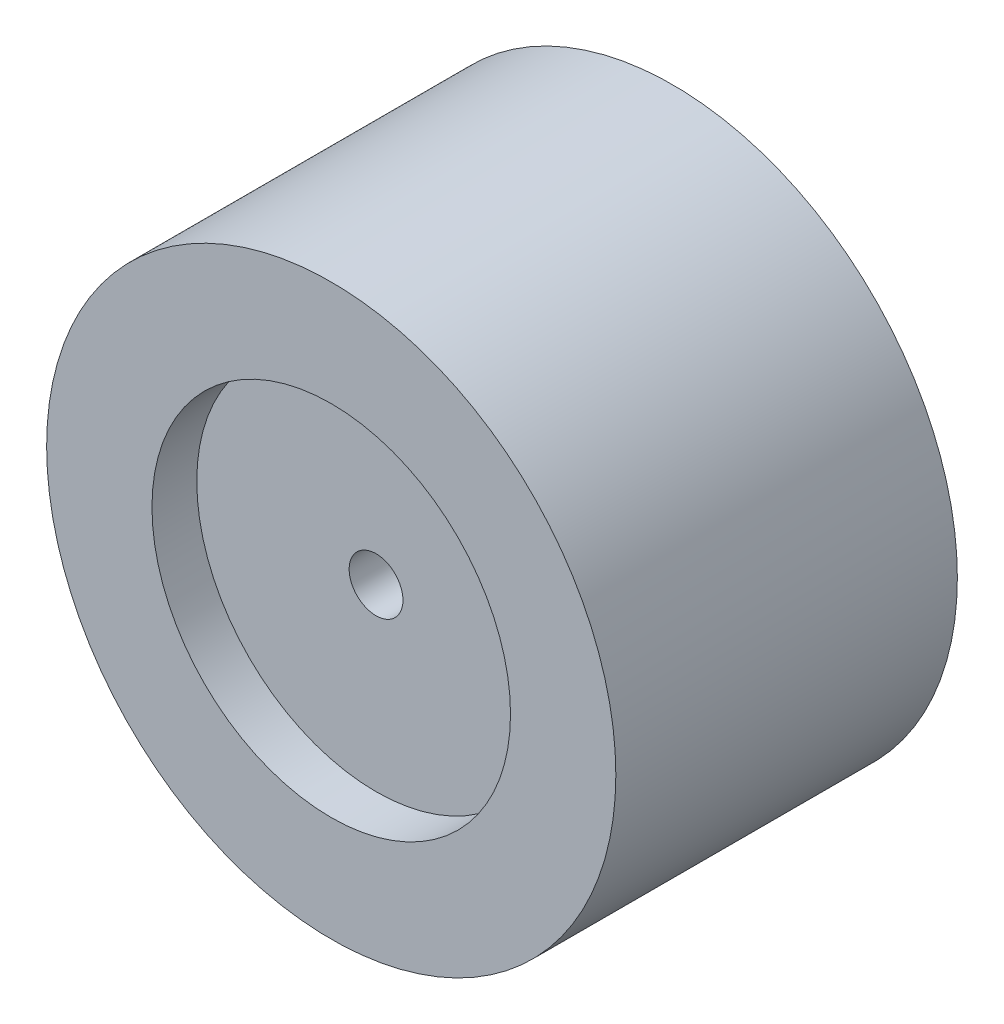
ISO-10303-21;
HEADER;
FILE_DESCRIPTION(('STEP AP214'),'2;1');
FILE_NAME('part.step','',(''),(''),'','','');
FILE_SCHEMA(('AUTOMOTIVE_DESIGN { 1 0 10303 214 1 1 1 1 }'));
ENDSEC;
DATA;
#1=APPLICATION_CONTEXT('core data for automotive mechanical design processes');
#2=APPLICATION_PROTOCOL_DEFINITION('international standard','automotive_design',2000,#1);
#3=PRODUCT_CONTEXT('',#1,'mechanical');
#4=PRODUCT('Part','Part','',(#3));
#5=PRODUCT_RELATED_PRODUCT_CATEGORY('part','',(#4));
#6=PRODUCT_DEFINITION_FORMATION('','',#4);
#7=PRODUCT_DEFINITION_CONTEXT('part definition',#1,'design');
#8=PRODUCT_DEFINITION('design','',#6,#7);
#9=PRODUCT_DEFINITION_SHAPE('','',#8);
#10=(LENGTH_UNIT() NAMED_UNIT(*) SI_UNIT(.MILLI.,.METRE.));
#11=(NAMED_UNIT(*) PLANE_ANGLE_UNIT() SI_UNIT($,.RADIAN.));
#12=(NAMED_UNIT(*) SI_UNIT($,.STERADIAN.) SOLID_ANGLE_UNIT());
#13=UNCERTAINTY_MEASURE_WITH_UNIT(LENGTH_MEASURE(1.E-05),#10,'distance_accuracy_value','');
#14=(GEOMETRIC_REPRESENTATION_CONTEXT(3) GLOBAL_UNCERTAINTY_ASSIGNED_CONTEXT((#13)) GLOBAL_UNIT_ASSIGNED_CONTEXT((#10,
#11,#12)) REPRESENTATION_CONTEXT('',''));
#15=CARTESIAN_POINT('',(0.,0.,0.));
#16=DIRECTION('',(0.,0.,1.));
#17=DIRECTION('',(1.,0.,0.));
#18=AXIS2_PLACEMENT_3D('',#15,#16,#17);
#19=CARTESIAN_POINT('',(0.,0.,38.1));
#20=DIRECTION('',(0.,0.,-1.));
#21=DIRECTION('',(-1.,0.,0.));
#22=AXIS2_PLACEMENT_3D('',#19,#20,#21);
#23=CYLINDRICAL_SURFACE('',#22,3.);
#24=CARTESIAN_POINT('',(0.,0.,0.));
#25=DIRECTION('',(0.,0.,1.));
#26=DIRECTION('',(1.,0.,0.));
#27=AXIS2_PLACEMENT_3D('',#24,#25,#26);
#28=CIRCLE('',#27,3.);
#29=CARTESIAN_POINT('',(3.,0.,0.));
#30=VERTEX_POINT('',#29);
#31=EDGE_CURVE('E43',#30,#30,#28,.T.);
#32=ORIENTED_EDGE('',*,*,#31,.F.);
#33=EDGE_LOOP('',(#32));
#34=FACE_BOUND('',#33,.T.);
#35=CARTESIAN_POINT('',(0.,0.,33.1));
#36=DIRECTION('',(0.,0.,1.));
#37=DIRECTION('',(1.,0.,0.));
#38=AXIS2_PLACEMENT_3D('',#35,#36,#37);
#39=CIRCLE('',#38,3.);
#40=CARTESIAN_POINT('',(3.,0.,33.1));
#41=VERTEX_POINT('',#40);
#42=EDGE_CURVE('E34',#41,#41,#39,.T.);
#43=ORIENTED_EDGE('',*,*,#42,.T.);
#44=EDGE_LOOP('',(#43));
#45=FACE_BOUND('',#44,.T.);
#46=ADVANCED_FACE('F30',(#34,#45),#23,.F.);
#47=CARTESIAN_POINT('',(0.,0.,38.1));
#48=DIRECTION('',(0.,0.,1.));
#49=DIRECTION('',(1.,0.,0.));
#50=AXIS2_PLACEMENT_3D('',#47,#48,#49);
#51=PLANE('',#50);
#52=CARTESIAN_POINT('',(0.,0.,38.1));
#53=DIRECTION('',(0.,0.,1.));
#54=DIRECTION('',(1.,0.,0.));
#55=AXIS2_PLACEMENT_3D('',#52,#53,#54);
#56=CIRCLE('',#55,20.);
#57=CARTESIAN_POINT('',(20.,0.,38.1));
#58=VERTEX_POINT('',#57);
#59=EDGE_CURVE('E47',#58,#58,#56,.T.);
#60=ORIENTED_EDGE('',*,*,#59,.F.);
#61=EDGE_LOOP('',(#60));
#62=FACE_BOUND('',#61,.T.);
#63=CARTESIAN_POINT('',(0.,0.,38.1));
#64=DIRECTION('',(0.,0.,1.));
#65=DIRECTION('',(1.,0.,0.));
#66=AXIS2_PLACEMENT_3D('',#63,#64,#65);
#67=CIRCLE('',#66,31.75);
#68=CARTESIAN_POINT('',(31.75,0.,38.1));
#69=VERTEX_POINT('',#68);
#70=EDGE_CURVE('E10',#69,#69,#67,.T.);
#71=ORIENTED_EDGE('',*,*,#70,.T.);
#72=EDGE_LOOP('',(#71));
#73=FACE_BOUND('',#72,.T.);
#74=ADVANCED_FACE('F68',(#62,#73),#51,.T.);
#75=CARTESIAN_POINT('',(0.,0.,0.));
#76=DIRECTION('',(0.,0.,1.));
#77=DIRECTION('',(1.,0.,0.));
#78=AXIS2_PLACEMENT_3D('',#75,#76,#77);
#79=PLANE('',#78);
#80=CARTESIAN_POINT('',(0.,0.,0.));
#81=DIRECTION('',(0.,0.,1.));
#82=DIRECTION('',(1.,0.,0.));
#83=AXIS2_PLACEMENT_3D('',#80,#81,#82);
#84=CIRCLE('',#83,31.75);
#85=CARTESIAN_POINT('',(31.75,0.,0.));
#86=VERTEX_POINT('',#85);
#87=EDGE_CURVE('E38',#86,#86,#84,.T.);
#88=ORIENTED_EDGE('',*,*,#87,.F.);
#89=EDGE_LOOP('',(#88));
#90=FACE_BOUND('',#89,.T.);
#91=ORIENTED_EDGE('',*,*,#31,.T.);
#92=EDGE_LOOP('',(#91));
#93=FACE_BOUND('',#92,.T.);
#94=ADVANCED_FACE('F74',(#90,#93),#79,.F.);
#95=CARTESIAN_POINT('',(0.,0.,38.1));
#96=DIRECTION('',(0.,0.,-1.));
#97=DIRECTION('',(-1.,0.,0.));
#98=AXIS2_PLACEMENT_3D('',#95,#96,#97);
#99=CYLINDRICAL_SURFACE('',#98,31.75);
#100=ORIENTED_EDGE('',*,*,#70,.F.);
#101=EDGE_LOOP('',(#100));
#102=FACE_BOUND('',#101,.T.);
#103=ORIENTED_EDGE('',*,*,#87,.T.);
#104=EDGE_LOOP('',(#103));
#105=FACE_BOUND('',#104,.T.);
#106=ADVANCED_FACE('F32',(#102,#105),#99,.T.);
#107=CARTESIAN_POINT('',(0.,0.,33.1));
#108=DIRECTION('',(0.,0.,1.));
#109=DIRECTION('',(1.,0.,0.));
#110=AXIS2_PLACEMENT_3D('',#107,#108,#109);
#111=CYLINDRICAL_SURFACE('',#110,20.);
#112=CARTESIAN_POINT('',(0.,0.,33.1));
#113=DIRECTION('',(0.,0.,1.));
#114=DIRECTION('',(1.,0.,0.));
#115=AXIS2_PLACEMENT_3D('',#112,#113,#114);
#116=CIRCLE('',#115,20.);
#117=CARTESIAN_POINT('',(20.,0.,33.1));
#118=VERTEX_POINT('',#117);
#119=EDGE_CURVE('E50',#118,#118,#116,.T.);
#120=ORIENTED_EDGE('',*,*,#119,.F.);
#121=EDGE_LOOP('',(#120));
#122=FACE_BOUND('',#121,.T.);
#123=ORIENTED_EDGE('',*,*,#59,.T.);
#124=EDGE_LOOP('',(#123));
#125=FACE_BOUND('',#124,.T.);
#126=ADVANCED_FACE('F60',(#122,#125),#111,.F.);
#127=CARTESIAN_POINT('',(0.,0.,33.1));
#128=DIRECTION('',(0.,0.,1.));
#129=DIRECTION('',(1.,0.,0.));
#130=AXIS2_PLACEMENT_3D('',#127,#128,#129);
#131=PLANE('',#130);
#132=ORIENTED_EDGE('',*,*,#42,.F.);
#133=EDGE_LOOP('',(#132));
#134=FACE_BOUND('',#133,.T.);
#135=ORIENTED_EDGE('',*,*,#119,.T.);
#136=EDGE_LOOP('',(#135));
#137=FACE_BOUND('',#136,.T.);
#138=ADVANCED_FACE('F58',(#134,#137),#131,.T.);
#139=CLOSED_SHELL('',(#46,#74,#94,#106,#126,#138));
#140=MANIFOLD_SOLID_BREP('B2',#139);
#141=ADVANCED_BREP_SHAPE_REPRESENTATION('',(#18,#140),#14);
#142=SHAPE_DEFINITION_REPRESENTATION(#9,#141);
ENDSEC;
END-ISO-10303-21;
